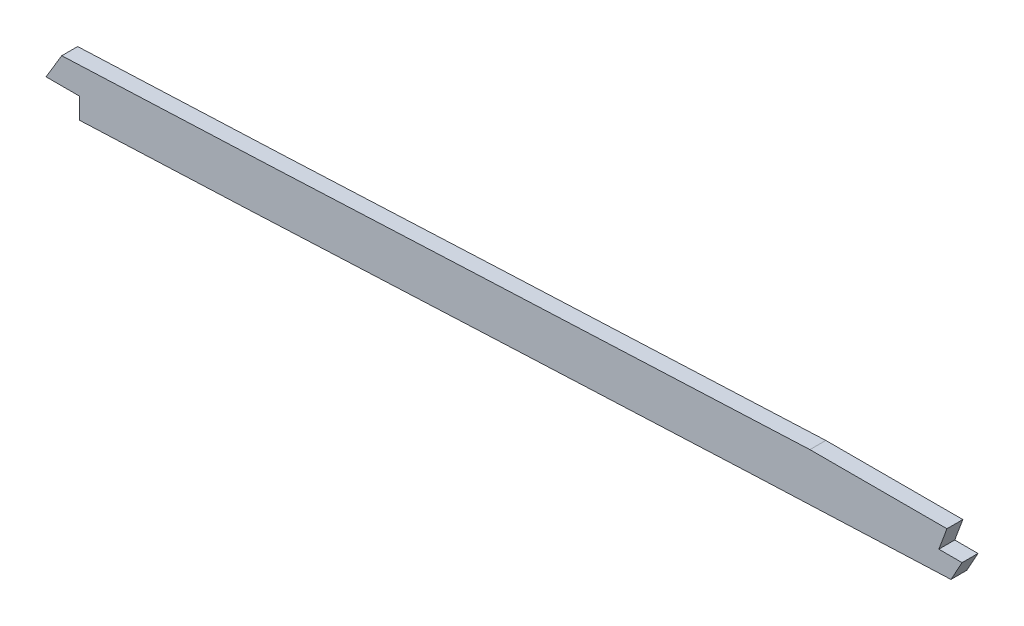
ISO-10303-21;
HEADER;
FILE_DESCRIPTION(('STEP AP214'),'2;1');
FILE_NAME('part.step','',(''),(''),'','','');
FILE_SCHEMA(('AUTOMOTIVE_DESIGN { 1 0 10303 214 1 1 1 1 }'));
ENDSEC;
DATA;
#1=APPLICATION_CONTEXT('core data for automotive mechanical design processes');
#2=APPLICATION_PROTOCOL_DEFINITION('international standard','automotive_design',2000,#1);
#3=PRODUCT_CONTEXT('',#1,'mechanical');
#4=PRODUCT('Part','Part','',(#3));
#5=PRODUCT_RELATED_PRODUCT_CATEGORY('part','',(#4));
#6=PRODUCT_DEFINITION_FORMATION('','',#4);
#7=PRODUCT_DEFINITION_CONTEXT('part definition',#1,'design');
#8=PRODUCT_DEFINITION('design','',#6,#7);
#9=PRODUCT_DEFINITION_SHAPE('','',#8);
#10=(LENGTH_UNIT() NAMED_UNIT(*) SI_UNIT(.MILLI.,.METRE.));
#11=(NAMED_UNIT(*) PLANE_ANGLE_UNIT() SI_UNIT($,.RADIAN.));
#12=(NAMED_UNIT(*) SI_UNIT($,.STERADIAN.) SOLID_ANGLE_UNIT());
#13=UNCERTAINTY_MEASURE_WITH_UNIT(LENGTH_MEASURE(1.E-05),#10,'distance_accuracy_value','');
#14=(GEOMETRIC_REPRESENTATION_CONTEXT(3) GLOBAL_UNCERTAINTY_ASSIGNED_CONTEXT((#13)) GLOBAL_UNIT_ASSIGNED_CONTEXT((#10,
#11,#12)) REPRESENTATION_CONTEXT('',''));
#15=CARTESIAN_POINT('',(0.,0.,0.));
#16=DIRECTION('',(0.,0.,1.));
#17=DIRECTION('',(1.,0.,0.));
#18=AXIS2_PLACEMENT_3D('',#15,#16,#17);
#19=CARTESIAN_POINT('',(2698.48667469404,11.4806601503293,3.175));
#20=CARTESIAN_POINT('',(2691.24737670604,10.9833200828121,3.175));
#21=CARTESIAN_POINT('',(2679.19516047804,10.1655376868452,3.175));
#22=CARTESIAN_POINT('',(2662.27652557768,9.03876140898899,3.175));
#23=CARTESIAN_POINT('',(2635.66628230206,7.2924691456857,3.175));
#24=CARTESIAN_POINT('',(2596.85766552893,4.8260568530791,3.175));
#25=CARTESIAN_POINT('',(2545.72974303923,1.75834409257586,3.175));
#26=CARTESIAN_POINT('',(2494.40530570724,-1.09855523520035,3.175));
#27=CARTESIAN_POINT('',(2451.53302226734,-3.26657329681936,3.175));
#28=CARTESIAN_POINT('',(2417.1983167563,-4.86708361008882,3.175));
#29=CARTESIAN_POINT('',(2391.45707691927,-6.00358923536048,3.175));
#30=CARTESIAN_POINT('',(2365.63473630713,-7.08685458139135,3.175));
#31=CARTESIAN_POINT('',(2339.54628467245,-8.13772994402807,3.175));
#32=CARTESIAN_POINT('',(2313.46613297408,-9.16513837136649,3.175));
#33=CARTESIAN_POINT('',(2287.61237548634,-10.1794782148021,3.175));
#34=CARTESIAN_POINT('',(2261.7633474368,-11.2010322967668,3.175));
#35=CARTESIAN_POINT('',(2227.28532971514,-12.5838425566113,3.175));
#36=CARTESIAN_POINT('',(2184.17556939327,-14.3660723604172,3.175));
#37=CARTESIAN_POINT('',(2132.42906611447,-16.6074278682384,3.175));
#38=CARTESIAN_POINT('',(2063.42552339989,-19.708920484548,3.175));
#39=CARTESIAN_POINT('',(1977.17490763451,-23.7005433130483,3.175));
#40=CARTESIAN_POINT('',(1873.73245143151,-28.149389220677,3.175));
#41=CARTESIAN_POINT('',(1770.37461881016,-31.6574686487852,3.175));
#42=CARTESIAN_POINT('',(1667.08568781321,-33.7931175563218,3.175));
#43=CARTESIAN_POINT('',(1581.01109449057,-34.3831888311612,3.175));
#44=CARTESIAN_POINT('',(1512.07397125959,-34.4278026003723,3.175));
#45=CARTESIAN_POINT('',(1443.06151347714,-34.4095104024296,3.175));
#46=CARTESIAN_POINT('',(1356.80092787913,-34.4244328117572,3.175));
#47=CARTESIAN_POINT('',(1218.79462695393,-34.4184647879491,3.175));
#48=CARTESIAN_POINT('',(1115.28902278569,-34.4207027968771,3.175));
#49=CARTESIAN_POINT('',(1046.28548189005,-34.4207027968771,3.175));
#50=B_SPLINE_CURVE_WITH_KNOTS('',3,(#19,#20,#21,#22,#23,#24,#25,#26,#27,#28,#29,#30,#31,#32,#33,
#34,#35,#36,#37,#38,#39,#40,#41,#42,#43,#44,#45,#46,#47,#48,#49),.UNSPECIFIED.,.F.,.F.,(4,1,1,1,
1,1,1,1,1,1,1,1,1,1,1,1,1,1,1,1,1,1,1,1,1,1,1,1,4),(100.654804519159,102.842388131745,
104.300777206802,105.766098402935,110.877392286712,115.988686170488,121.099980054264,
126.21127393804,128.766920879929,131.322567821817,133.878214763705,136.433861705593,
138.989508647481,141.545155589369,144.100802531257,146.656449473146,151.767743356922,
156.879037240698,161.990331124474,172.212918892027,182.43550665958,192.658094427132,
202.880682194685,213.103269962237,218.214563846014,223.32585772979,233.548445497342,
243.771033264895,264.2162088),.UNSPECIFIED.);
#51=DIRECTION('',(0.,0.,-1.));
#52=VECTOR('',#51,1.);
#53=SURFACE_OF_LINEAR_EXTRUSION('',#50,#52);
#54=CARTESIAN_POINT('',(2698.48667469404,11.4806601503293,-3.175));
#55=CARTESIAN_POINT('',(2691.24737670604,10.9833200828121,-3.175));
#56=CARTESIAN_POINT('',(2679.19516047804,10.1655376868452,-3.175));
#57=CARTESIAN_POINT('',(2662.27652557768,9.03876140898899,-3.175));
#58=CARTESIAN_POINT('',(2635.66628230206,7.2924691456857,-3.175));
#59=CARTESIAN_POINT('',(2596.85766552893,4.8260568530791,-3.175));
#60=CARTESIAN_POINT('',(2545.72974303923,1.75834409257586,-3.175));
#61=CARTESIAN_POINT('',(2494.40530570724,-1.09855523520035,-3.175));
#62=CARTESIAN_POINT('',(2451.53302226734,-3.26657329681936,-3.175));
#63=CARTESIAN_POINT('',(2417.1983167563,-4.86708361008882,-3.175));
#64=CARTESIAN_POINT('',(2391.45707691927,-6.00358923536048,-3.175));
#65=CARTESIAN_POINT('',(2365.63473630713,-7.08685458139135,-3.175));
#66=CARTESIAN_POINT('',(2339.54628467245,-8.13772994402807,-3.175));
#67=CARTESIAN_POINT('',(2313.46613297408,-9.16513837136649,-3.175));
#68=CARTESIAN_POINT('',(2287.61237548634,-10.1794782148021,-3.175));
#69=CARTESIAN_POINT('',(2261.7633474368,-11.2010322967668,-3.175));
#70=CARTESIAN_POINT('',(2227.28532971514,-12.5838425566113,-3.175));
#71=CARTESIAN_POINT('',(2184.17556939327,-14.3660723604172,-3.175));
#72=CARTESIAN_POINT('',(2132.42906611447,-16.6074278682384,-3.175));
#73=CARTESIAN_POINT('',(2063.42552339989,-19.708920484548,-3.175));
#74=CARTESIAN_POINT('',(1977.17490763451,-23.7005433130483,-3.175));
#75=CARTESIAN_POINT('',(1873.73245143151,-28.149389220677,-3.175));
#76=CARTESIAN_POINT('',(1770.37461881016,-31.6574686487852,-3.175));
#77=CARTESIAN_POINT('',(1667.08568781321,-33.7931175563218,-3.175));
#78=CARTESIAN_POINT('',(1581.01109449057,-34.3831888311612,-3.175));
#79=CARTESIAN_POINT('',(1512.07397125959,-34.4278026003723,-3.175));
#80=CARTESIAN_POINT('',(1443.06151347714,-34.4095104024296,-3.175));
#81=CARTESIAN_POINT('',(1356.80092787913,-34.4244328117572,-3.175));
#82=CARTESIAN_POINT('',(1218.79462695393,-34.4184647879491,-3.175));
#83=CARTESIAN_POINT('',(1115.28902278569,-34.4207027968771,-3.175));
#84=CARTESIAN_POINT('',(1046.28548189005,-34.4207027968771,-3.175));
#85=B_SPLINE_CURVE_WITH_KNOTS('',3,(#54,#55,#56,#57,#58,#59,#60,#61,#62,#63,#64,#65,#66,#67,#68,
#69,#70,#71,#72,#73,#74,#75,#76,#77,#78,#79,#80,#81,#82,#83,#84),.UNSPECIFIED.,.F.,.F.,(4,1,1,1,
1,1,1,1,1,1,1,1,1,1,1,1,1,1,1,1,1,1,1,1,1,1,1,1,4),(100.654804519159,102.842388131745,
104.300777206802,105.766098402935,110.877392286712,115.988686170488,121.099980054264,
126.21127393804,128.766920879929,131.322567821817,133.878214763705,136.433861705593,
138.989508647481,141.545155589369,144.100802531257,146.656449473146,151.767743356922,
156.879037240698,161.990331124474,172.212918892027,182.43550665958,192.658094427132,
202.880682194685,213.103269962237,218.214563846014,223.32585772979,233.548445497342,
243.771033264895,264.2162088),.UNSPECIFIED.);
#86=CARTESIAN_POINT('',(2187.00995958023,-14.2632600319784,-3.175));
#87=VERTEX_POINT('',#86);
#88=CARTESIAN_POINT('',(1888.27498536147,-27.4246170150693,-3.175));
#89=VERTEX_POINT('',#88);
#90=EDGE_CURVE('E235',#87,#89,#85,.T.);
#91=ORIENTED_EDGE('',*,*,#90,.T.);
#92=DIRECTION('',(0.,0.,1.));
#93=VECTOR('',#92,1.);
#94=CARTESIAN_POINT('',(1888.27498536147,-27.4246170150693,-4.445));
#95=LINE('',#94,#93);
#96=CARTESIAN_POINT('',(1888.27498536147,-27.4246170150693,3.175));
#97=VERTEX_POINT('',#96);
#98=EDGE_CURVE('E140',#89,#97,#95,.T.);
#99=ORIENTED_EDGE('',*,*,#98,.T.);
#100=CARTESIAN_POINT('',(2187.00995958023,-14.2632600319784,3.175));
#101=VERTEX_POINT('',#100);
#102=EDGE_CURVE('E230',#101,#97,#50,.T.);
#103=ORIENTED_EDGE('',*,*,#102,.F.);
#104=CARTESIAN_POINT('',(2187.00995946967,-14.2632600366466,3.175));
#105=DIRECTION('',(0.,0.,-1.));
#106=VECTOR('',#105,1.);
#107=LINE('',#104,#106);
#108=EDGE_CURVE('E175',#87,#101,#107,.F.);
#109=ORIENTED_EDGE('',*,*,#108,.F.);
#110=EDGE_LOOP('',(#91,#99,#103,#109));
#111=FACE_BOUND('',#110,.T.);
#112=ADVANCED_FACE('F38',(#111),#53,.F.);
#113=CARTESIAN_POINT('',(2699.79233294449,-7.52454325644929,3.175));
#114=CARTESIAN_POINT('',(2639.63682069028,-11.6572294058032,3.175));
#115=CARTESIAN_POINT('',(2579.48130742255,-15.435846921513,3.175));
#116=CARTESIAN_POINT('',(2518.49810546626,-19.1485286488731,3.175));
#117=CARTESIAN_POINT('',(2436.3555443117,-23.2523639114786,3.175));
#118=CARTESIAN_POINT('',(2354.21298315715,-26.6314864233564,3.175));
#119=CARTESIAN_POINT('',(2332.5703304682,-27.4809881692809,3.175));
#120=CARTESIAN_POINT('',(2156.26863942885,-34.3777685431634,3.175));
#121=CARTESIAN_POINT('',(1979.96694737597,-41.6286312484567,3.175));
#122=CARTESIAN_POINT('',(1824.11427763497,-52.7712658766203,3.175));
#123=CARTESIAN_POINT('',(1636.92860677809,-53.5795698486924,3.175));
#124=CARTESIAN_POINT('',(1449.7429359212,-53.4540246131279,3.175));
#125=CARTESIAN_POINT('',(1418.00673093479,-53.4707027968771,3.175));
#126=CARTESIAN_POINT('',(1324.89933614602,-53.4707027968771,3.175));
#127=CARTESIAN_POINT('',(1231.79194034372,-53.4707027968771,3.175));
#128=CARTESIAN_POINT('',(1170.4412693194,-53.4707027968771,3.175));
#129=CARTESIAN_POINT('',(1108.78407581299,-53.4707027968771,3.175));
#130=CARTESIAN_POINT('',(1047.12688234629,-53.4707027968771,3.175));
#131=CARTESIAN_POINT('',(1046.84641418849,-53.4707027968771,3.175));
#132=CARTESIAN_POINT('',(1046.56594718406,-53.4707027968771,3.175));
#133=CARTESIAN_POINT('',(1046.28548189005,-53.4707027968771,3.175));
#134=(BOUNDED_CURVE() B_SPLINE_CURVE(5,(#113,#114,#115,#116,#117,#118,#119,#120,#121,#122,#123,
#124,#125,#126,#127,#128,#129,#130,#131,#132,#133),.UNSPECIFIED.,.F.,
.F.) B_SPLINE_CURVE_WITH_KNOTS((6,3,3,3,3,3,6),(100.654804519159,130.927896619159,
141.337054719159,218.101815019159,233.772059419159,264.077723219159,264.2162088),
.UNSPECIFIED.) CURVE() GEOMETRIC_REPRESENTATION_ITEM() RATIONAL_B_SPLINE_CURVE((1.,1.,1.,1.,1.,
1.,1.,1.,1.,1.,1.,1.,1.,1.,1.,1.,1.,1.,1.,1.,1.)) REPRESENTATION_ITEM(''));
#135=DIRECTION('',(0.,0.,-1.));
#136=VECTOR('',#135,1.);
#137=SURFACE_OF_LINEAR_EXTRUSION('',#134,#136);
#138=DIRECTION('',(0.,0.,-1.));
#139=VECTOR('',#138,1.);
#140=CARTESIAN_POINT('',(1895.4063265018,-46.2049441321549,3.175));
#141=LINE('',#140,#139);
#142=CARTESIAN_POINT('',(1895.4063265018,-46.2049441321549,-3.175));
#143=VERTEX_POINT('',#142);
#144=CARTESIAN_POINT('',(1895.4063265018,-46.2049441321549,3.175));
#145=VERTEX_POINT('',#144);
#146=EDGE_CURVE('E126',#143,#145,#141,.F.);
#147=ORIENTED_EDGE('',*,*,#146,.F.);
#148=CARTESIAN_POINT('',(2699.79233294449,-7.52454325644929,-3.175));
#149=CARTESIAN_POINT('',(2639.63682069028,-11.6572294058032,-3.175));
#150=CARTESIAN_POINT('',(2579.48130742255,-15.435846921513,-3.175));
#151=CARTESIAN_POINT('',(2518.49810546626,-19.1485286488731,-3.175));
#152=CARTESIAN_POINT('',(2436.3555443117,-23.2523639114786,-3.175));
#153=CARTESIAN_POINT('',(2354.21298315715,-26.6314864233564,-3.175));
#154=CARTESIAN_POINT('',(2332.5703304682,-27.4809881692809,-3.175));
#155=CARTESIAN_POINT('',(2156.26863942885,-34.3777685431634,-3.175));
#156=CARTESIAN_POINT('',(1979.96694737597,-41.6286312484567,-3.175));
#157=CARTESIAN_POINT('',(1824.11427763497,-52.7712658766203,-3.175));
#158=CARTESIAN_POINT('',(1636.92860677809,-53.5795698486924,-3.175));
#159=CARTESIAN_POINT('',(1449.7429359212,-53.4540246131279,-3.175));
#160=CARTESIAN_POINT('',(1418.00673093479,-53.4707027968771,-3.175));
#161=CARTESIAN_POINT('',(1324.89933614602,-53.4707027968771,-3.175));
#162=CARTESIAN_POINT('',(1231.79194034372,-53.4707027968771,-3.175));
#163=CARTESIAN_POINT('',(1170.4412693194,-53.4707027968771,-3.175));
#164=CARTESIAN_POINT('',(1108.78407581299,-53.4707027968771,-3.175));
#165=CARTESIAN_POINT('',(1047.12688234629,-53.4707027968771,-3.175));
#166=CARTESIAN_POINT('',(1046.84641418849,-53.4707027968771,-3.175));
#167=CARTESIAN_POINT('',(1046.56594718406,-53.4707027968771,-3.175));
#168=CARTESIAN_POINT('',(1046.28548189005,-53.4707027968771,-3.175));
#169=(BOUNDED_CURVE() B_SPLINE_CURVE(5,(#148,#149,#150,#151,#152,#153,#154,#155,#156,#157,#158,
#159,#160,#161,#162,#163,#164,#165,#166,#167,#168),.UNSPECIFIED.,.F.,
.F.) B_SPLINE_CURVE_WITH_KNOTS((6,3,3,3,3,3,6),(100.654804519159,130.927896619159,
141.337054719159,218.101815019159,233.772059419159,264.077723219159,264.2162088),
.UNSPECIFIED.) CURVE() GEOMETRIC_REPRESENTATION_ITEM() RATIONAL_B_SPLINE_CURVE((1.,1.,1.,1.,1.,
1.,1.,1.,1.,1.,1.,1.,1.,1.,1.,1.,1.,1.,1.,1.,1.)) REPRESENTATION_ITEM(''));
#170=CARTESIAN_POINT('',(2243.33769015545,-31.006850231288,-3.175));
#171=VERTEX_POINT('',#170);
#172=EDGE_CURVE('E221',#171,#143,#169,.T.);
#173=ORIENTED_EDGE('',*,*,#172,.F.);
#174=DIRECTION('',(0.,0.,1.));
#175=VECTOR('',#174,1.);
#176=CARTESIAN_POINT('',(2243.33769015545,-31.006850231288,-4.445));
#177=LINE('',#176,#175);
#178=CARTESIAN_POINT('',(2243.33769015545,-31.006850231288,3.175));
#179=VERTEX_POINT('',#178);
#180=EDGE_CURVE('E131',#171,#179,#177,.T.);
#181=ORIENTED_EDGE('',*,*,#180,.T.);
#182=EDGE_CURVE('E190',#179,#145,#134,.T.);
#183=ORIENTED_EDGE('',*,*,#182,.T.);
#184=EDGE_LOOP('',(#147,#173,#181,#183));
#185=FACE_BOUND('',#184,.T.);
#186=ADVANCED_FACE('F40',(#185),#137,.T.);
#187=CARTESIAN_POINT('',(0.,0.,3.175));
#188=DIRECTION('',(0.,0.,1.));
#189=DIRECTION('',(1.,0.,0.));
#190=AXIS2_PLACEMENT_3D('',#187,#188,#189);
#191=PLANE('',#190);
#192=DIRECTION('',(0.516228970807182,0.856450611360257,0.));
#193=VECTOR('',#192,1.);
#194=CARTESIAN_POINT('',(1888.27498536147,-27.4246170150693,3.175));
#195=LINE('',#194,#193);
#196=CARTESIAN_POINT('',(1881.98614013018,-37.8581371150141,3.175));
#197=VERTEX_POINT('',#196);
#198=EDGE_CURVE('E120',#197,#97,#195,.T.);
#199=ORIENTED_EDGE('',*,*,#198,.F.);
#200=DIRECTION('',(-1.,0.,0.));
#201=VECTOR('',#200,1.);
#202=CARTESIAN_POINT('',(1881.98614013018,-37.8581371150141,3.175));
#203=LINE('',#202,#201);
#204=CARTESIAN_POINT('',(1895.4063265018,-37.8581371150141,3.175));
#205=VERTEX_POINT('',#204);
#206=EDGE_CURVE('E114',#205,#197,#203,.T.);
#207=ORIENTED_EDGE('',*,*,#206,.F.);
#208=DIRECTION('',(0.,1.,0.));
#209=VECTOR('',#208,1.);
#210=CARTESIAN_POINT('',(1895.4063265018,-37.8581371150141,3.175));
#211=LINE('',#210,#209);
#212=EDGE_CURVE('E123',#145,#205,#211,.T.);
#213=ORIENTED_EDGE('',*,*,#212,.F.);
#214=ORIENTED_EDGE('',*,*,#182,.F.);
#215=DIRECTION('',(-0.483088651994543,-0.875571444437343,0.));
#216=VECTOR('',#215,1.);
#217=CARTESIAN_POINT('',(2247.77744494471,-22.9600404009782,3.175));
#218=LINE('',#217,#216);
#219=CARTESIAN_POINT('',(2247.77744494471,-22.9600404009782,3.175));
#220=VERTEX_POINT('',#219);
#221=EDGE_CURVE('E154',#220,#179,#218,.T.);
#222=ORIENTED_EDGE('',*,*,#221,.F.);
#223=DIRECTION('',(1.,0.,0.));
#224=VECTOR('',#223,1.);
#225=CARTESIAN_POINT('',(2238.4954326079,-22.9600404009782,3.175));
#226=LINE('',#225,#224);
#227=CARTESIAN_POINT('',(2238.4954326079,-22.9600404009782,3.175));
#228=VERTEX_POINT('',#227);
#229=EDGE_CURVE('E150',#228,#220,#226,.T.);
#230=ORIENTED_EDGE('',*,*,#229,.F.);
#231=DIRECTION('',(-0.348051925699609,-0.937475256749101,0.));
#232=VECTOR('',#231,1.);
#233=CARTESIAN_POINT('',(2241.72424439042,-14.2632600319784,3.175));
#234=LINE('',#233,#232);
#235=CARTESIAN_POINT('',(2241.72424439042,-14.2632600319784,3.175));
#236=VERTEX_POINT('',#235);
#237=EDGE_CURVE('E146',#236,#228,#234,.T.);
#238=ORIENTED_EDGE('',*,*,#237,.F.);
#239=DIRECTION('',(1.,0.,0.));
#240=VECTOR('',#239,1.);
#241=CARTESIAN_POINT('',(0.,-14.2632600366532,3.175));
#242=LINE('',#241,#240);
#243=EDGE_CURVE('E170',#101,#236,#242,.T.);
#244=ORIENTED_EDGE('',*,*,#243,.F.);
#245=ORIENTED_EDGE('',*,*,#102,.T.);
#246=EDGE_LOOP('',(#199,#207,#213,#214,#222,#230,#238,#244,#245));
#247=FACE_BOUND('',#246,.T.);
#248=ADVANCED_FACE('F133',(#247),#191,.T.);
#249=CARTESIAN_POINT('',(0.,0.,-3.175));
#250=DIRECTION('',(0.,0.,1.));
#251=DIRECTION('',(1.,0.,0.));
#252=AXIS2_PLACEMENT_3D('',#249,#250,#251);
#253=PLANE('',#252);
#254=DIRECTION('',(-1.,0.,0.));
#255=VECTOR('',#254,1.);
#256=CARTESIAN_POINT('',(0.,-37.8581371150141,-3.175));
#257=LINE('',#256,#255);
#258=CARTESIAN_POINT('',(1895.4063265018,-37.8581371150141,-3.175));
#259=VERTEX_POINT('',#258);
#260=CARTESIAN_POINT('',(1881.98614013018,-37.8581371150141,-3.175));
#261=VERTEX_POINT('',#260);
#262=EDGE_CURVE('E48',#259,#261,#257,.T.);
#263=ORIENTED_EDGE('',*,*,#262,.T.);
#264=DIRECTION('',(0.516228970807182,0.856450611360257,0.));
#265=VECTOR('',#264,1.);
#266=CARTESIAN_POINT('',(1397.18924481056,-842.16130656485,-3.175));
#267=LINE('',#266,#265);
#268=EDGE_CURVE('E11',#261,#89,#267,.T.);
#269=ORIENTED_EDGE('',*,*,#268,.T.);
#270=ORIENTED_EDGE('',*,*,#90,.F.);
#271=DIRECTION('',(1.,0.,0.));
#272=VECTOR('',#271,1.);
#273=CARTESIAN_POINT('',(0.,-14.2632600366532,-3.175));
#274=LINE('',#273,#272);
#275=CARTESIAN_POINT('',(2241.72424438869,-14.2632600366464,-3.175));
#276=VERTEX_POINT('',#275);
#277=EDGE_CURVE('E171',#87,#276,#274,.T.);
#278=ORIENTED_EDGE('',*,*,#277,.T.);
#279=DIRECTION('',(-0.348051925699609,-0.937475256749101,0.));
#280=VECTOR('',#279,1.);
#281=CARTESIAN_POINT('',(1974.81540898759,-733.180210412045,-3.175));
#282=LINE('',#281,#280);
#283=CARTESIAN_POINT('',(2238.4954326079,-22.9600404009782,-3.175));
#284=VERTEX_POINT('',#283);
#285=EDGE_CURVE('E63',#276,#284,#282,.T.);
#286=ORIENTED_EDGE('',*,*,#285,.T.);
#287=DIRECTION('',(1.,0.,0.));
#288=VECTOR('',#287,1.);
#289=CARTESIAN_POINT('',(0.,-22.9600404009782,-3.175));
#290=LINE('',#289,#288);
#291=CARTESIAN_POINT('',(2247.77744494471,-22.9600404009782,-3.175));
#292=VERTEX_POINT('',#291);
#293=EDGE_CURVE('E249',#284,#292,#290,.T.);
#294=ORIENTED_EDGE('',*,*,#293,.T.);
#295=DIRECTION('',(-0.483088651994543,-0.875571444437343,0.));
#296=VECTOR('',#295,1.);
#297=CARTESIAN_POINT('',(1732.91478655638,-956.120112844592,-3.175));
#298=LINE('',#297,#296);
#299=EDGE_CURVE('E253',#292,#171,#298,.T.);
#300=ORIENTED_EDGE('',*,*,#299,.T.);
#301=ORIENTED_EDGE('',*,*,#172,.T.);
#302=DIRECTION('',(0.,1.,0.));
#303=VECTOR('',#302,1.);
#304=CARTESIAN_POINT('',(1895.4063265018,0.,-3.175));
#305=LINE('',#304,#303);
#306=EDGE_CURVE('E257',#143,#259,#305,.T.);
#307=ORIENTED_EDGE('',*,*,#306,.T.);
#308=EDGE_LOOP('',(#263,#269,#270,#278,#286,#294,#300,#301,#307));
#309=FACE_BOUND('',#308,.T.);
#310=ADVANCED_FACE('F206',(#309),#253,.F.);
#311=CARTESIAN_POINT('',(0.,-14.2632600366532,-3.175));
#312=DIRECTION('',(0.,-1.,0.));
#313=DIRECTION('',(1.,0.,0.));
#314=AXIS2_PLACEMENT_3D('',#311,#312,#313);
#315=PLANE('',#314);
#316=ORIENTED_EDGE('',*,*,#243,.T.);
#317=DIRECTION('',(0.,0.,-1.));
#318=VECTOR('',#317,1.);
#319=CARTESIAN_POINT('',(2241.72424438869,-14.2632600366464,-3.175));
#320=LINE('',#319,#318);
#321=EDGE_CURVE('E234',#236,#276,#320,.T.);
#322=ORIENTED_EDGE('',*,*,#321,.T.);
#323=ORIENTED_EDGE('',*,*,#277,.F.);
#324=ORIENTED_EDGE('',*,*,#108,.T.);
#325=EDGE_LOOP('',(#316,#322,#323,#324));
#326=FACE_BOUND('',#325,.T.);
#327=ADVANCED_FACE('F195',(#326),#315,.F.);
#328=CARTESIAN_POINT('',(2247.77744494471,-22.9600404009782,-4.445));
#329=DIRECTION('',(-0.875571444437343,0.483088651994543,0.));
#330=DIRECTION('',(-0.483088651994543,-0.875571444437343,0.));
#331=AXIS2_PLACEMENT_3D('',#328,#329,#330);
#332=PLANE('',#331);
#333=DIRECTION('',(0.,0.,1.));
#334=VECTOR('',#333,1.);
#335=CARTESIAN_POINT('',(2247.77744494471,-22.9600404009782,-4.445));
#336=LINE('',#335,#334);
#337=EDGE_CURVE('E161',#292,#220,#336,.T.);
#338=ORIENTED_EDGE('',*,*,#337,.T.);
#339=ORIENTED_EDGE('',*,*,#221,.T.);
#340=ORIENTED_EDGE('',*,*,#180,.F.);
#341=ORIENTED_EDGE('',*,*,#299,.F.);
#342=EDGE_LOOP('',(#338,#339,#340,#341));
#343=FACE_BOUND('',#342,.T.);
#344=ADVANCED_FACE('F205',(#343),#332,.F.);
#345=CARTESIAN_POINT('',(2238.4954326079,-22.9600404009782,-4.445));
#346=DIRECTION('',(0.,-1.,0.));
#347=DIRECTION('',(0.,0.,-1.));
#348=AXIS2_PLACEMENT_3D('',#345,#346,#347);
#349=PLANE('',#348);
#350=DIRECTION('',(0.,0.,1.));
#351=VECTOR('',#350,1.);
#352=CARTESIAN_POINT('',(2238.4954326079,-22.9600404009782,-4.445));
#353=LINE('',#352,#351);
#354=EDGE_CURVE('E157',#284,#228,#353,.T.);
#355=ORIENTED_EDGE('',*,*,#354,.T.);
#356=ORIENTED_EDGE('',*,*,#229,.T.);
#357=ORIENTED_EDGE('',*,*,#337,.F.);
#358=ORIENTED_EDGE('',*,*,#293,.F.);
#359=EDGE_LOOP('',(#355,#356,#357,#358));
#360=FACE_BOUND('',#359,.T.);
#361=ADVANCED_FACE('F272',(#360),#349,.F.);
#362=CARTESIAN_POINT('',(2241.72424439042,-14.2632600319784,-4.445));
#363=DIRECTION('',(-0.937475256749101,0.348051925699609,0.));
#364=DIRECTION('',(-0.348051925699609,-0.937475256749101,0.));
#365=AXIS2_PLACEMENT_3D('',#362,#363,#364);
#366=PLANE('',#365);
#367=ORIENTED_EDGE('',*,*,#321,.F.);
#368=ORIENTED_EDGE('',*,*,#237,.T.);
#369=ORIENTED_EDGE('',*,*,#354,.F.);
#370=ORIENTED_EDGE('',*,*,#285,.F.);
#371=EDGE_LOOP('',(#367,#368,#369,#370));
#372=FACE_BOUND('',#371,.T.);
#373=ADVANCED_FACE('F207',(#372),#366,.F.);
#374=CARTESIAN_POINT('',(1888.27498536147,-27.4246170150693,-4.445));
#375=DIRECTION('',(0.856450611360257,-0.516228970807182,0.));
#376=DIRECTION('',(0.516228970807182,0.856450611360257,0.));
#377=AXIS2_PLACEMENT_3D('',#374,#375,#376);
#378=PLANE('',#377);
#379=DIRECTION('',(0.,0.,1.));
#380=VECTOR('',#379,1.);
#381=CARTESIAN_POINT('',(1881.98614013018,-37.8581371150141,-4.445));
#382=LINE('',#381,#380);
#383=EDGE_CURVE('E119',#261,#197,#382,.T.);
#384=ORIENTED_EDGE('',*,*,#383,.T.);
#385=ORIENTED_EDGE('',*,*,#198,.T.);
#386=ORIENTED_EDGE('',*,*,#98,.F.);
#387=ORIENTED_EDGE('',*,*,#268,.F.);
#388=EDGE_LOOP('',(#384,#385,#386,#387));
#389=FACE_BOUND('',#388,.T.);
#390=ADVANCED_FACE('F285',(#389),#378,.F.);
#391=CARTESIAN_POINT('',(1881.98614013018,-37.8581371150141,-4.445));
#392=DIRECTION('',(0.,1.,0.));
#393=DIRECTION('',(0.,0.,1.));
#394=AXIS2_PLACEMENT_3D('',#391,#392,#393);
#395=PLANE('',#394);
#396=DIRECTION('',(0.,0.,1.));
#397=VECTOR('',#396,1.);
#398=CARTESIAN_POINT('',(1895.4063265018,-37.8581371150141,-4.445));
#399=LINE('',#398,#397);
#400=EDGE_CURVE('E55',#259,#205,#399,.T.);
#401=ORIENTED_EDGE('',*,*,#400,.T.);
#402=ORIENTED_EDGE('',*,*,#206,.T.);
#403=ORIENTED_EDGE('',*,*,#383,.F.);
#404=ORIENTED_EDGE('',*,*,#262,.F.);
#405=EDGE_LOOP('',(#401,#402,#403,#404));
#406=FACE_BOUND('',#405,.T.);
#407=ADVANCED_FACE('F111',(#406),#395,.F.);
#408=CARTESIAN_POINT('',(1895.4063265018,-37.8581371150141,-4.445));
#409=DIRECTION('',(1.,0.,0.));
#410=DIRECTION('',(0.,0.,-1.));
#411=AXIS2_PLACEMENT_3D('',#408,#409,#410);
#412=PLANE('',#411);
#413=ORIENTED_EDGE('',*,*,#146,.T.);
#414=ORIENTED_EDGE('',*,*,#212,.T.);
#415=ORIENTED_EDGE('',*,*,#400,.F.);
#416=ORIENTED_EDGE('',*,*,#306,.F.);
#417=EDGE_LOOP('',(#413,#414,#415,#416));
#418=FACE_BOUND('',#417,.T.);
#419=ADVANCED_FACE('F124',(#418),#412,.F.);
#420=CLOSED_SHELL('',(#112,#186,#248,#310,#327,#344,#361,#373,#390,#407,#419));
#421=MANIFOLD_SOLID_BREP('B2',#420);
#422=ADVANCED_BREP_SHAPE_REPRESENTATION('',(#18,#421),#14);
#423=SHAPE_DEFINITION_REPRESENTATION(#9,#422);
ENDSEC;
END-ISO-10303-21;
